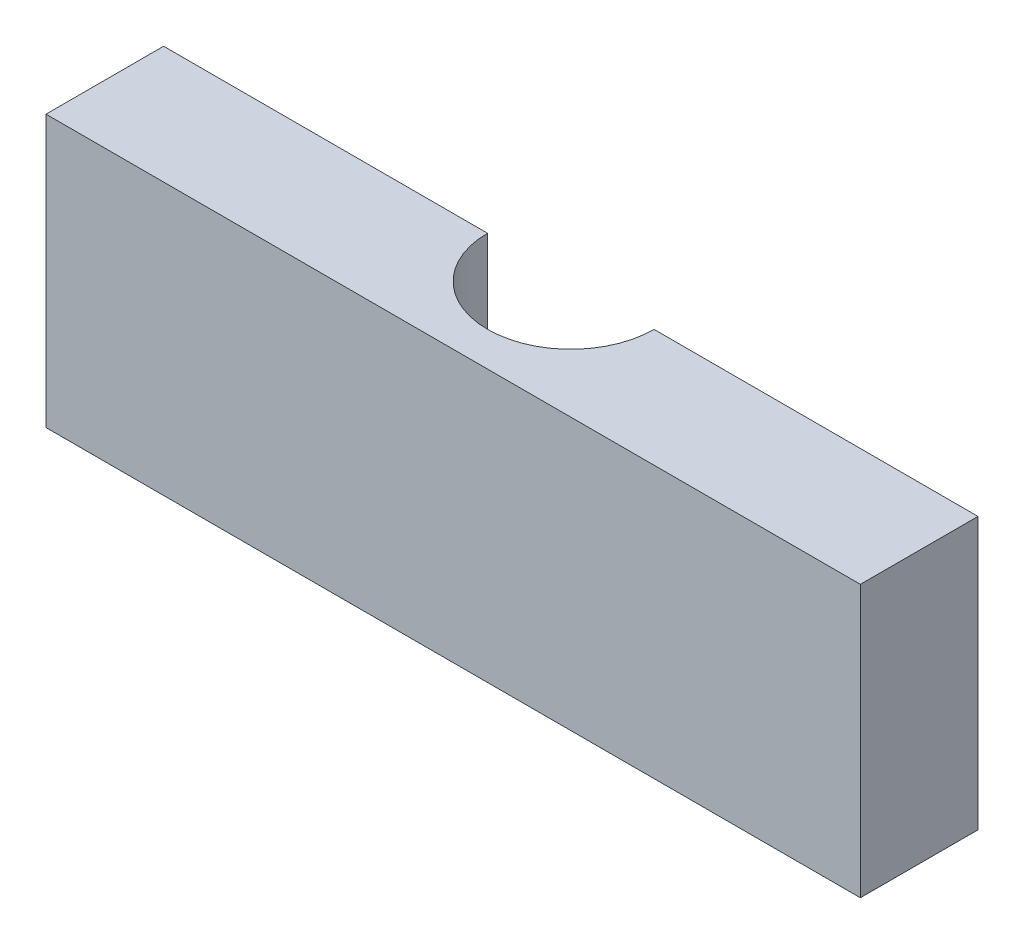
ISO-10303-21;
HEADER;
FILE_DESCRIPTION(('STEP AP214'),'2;1');
FILE_NAME('part.step','',(''),(''),'','','');
FILE_SCHEMA(('AUTOMOTIVE_DESIGN { 1 0 10303 214 1 1 1 1 }'));
ENDSEC;
DATA;
#1=APPLICATION_CONTEXT('core data for automotive mechanical design processes');
#2=APPLICATION_PROTOCOL_DEFINITION('international standard','automotive_design',2000,#1);
#3=PRODUCT_CONTEXT('',#1,'mechanical');
#4=PRODUCT('Part','Part','',(#3));
#5=PRODUCT_RELATED_PRODUCT_CATEGORY('part','',(#4));
#6=PRODUCT_DEFINITION_FORMATION('','',#4);
#7=PRODUCT_DEFINITION_CONTEXT('part definition',#1,'design');
#8=PRODUCT_DEFINITION('design','',#6,#7);
#9=PRODUCT_DEFINITION_SHAPE('','',#8);
#10=(LENGTH_UNIT() NAMED_UNIT(*) SI_UNIT(.MILLI.,.METRE.));
#11=(NAMED_UNIT(*) PLANE_ANGLE_UNIT() SI_UNIT($,.RADIAN.));
#12=(NAMED_UNIT(*) SI_UNIT($,.STERADIAN.) SOLID_ANGLE_UNIT());
#13=UNCERTAINTY_MEASURE_WITH_UNIT(LENGTH_MEASURE(1.E-05),#10,'distance_accuracy_value','');
#14=(GEOMETRIC_REPRESENTATION_CONTEXT(3) GLOBAL_UNCERTAINTY_ASSIGNED_CONTEXT((#13)) GLOBAL_UNIT_ASSIGNED_CONTEXT((#10,
#11,#12)) REPRESENTATION_CONTEXT('',''));
#15=CARTESIAN_POINT('',(0.,0.,0.));
#16=DIRECTION('',(0.,0.,1.));
#17=DIRECTION('',(1.,0.,0.));
#18=AXIS2_PLACEMENT_3D('',#15,#16,#17);
#19=CARTESIAN_POINT('',(0.,0.,0.));
#20=DIRECTION('',(0.,0.,1.));
#21=DIRECTION('',(1.,0.,0.));
#22=AXIS2_PLACEMENT_3D('',#19,#20,#21);
#23=PLANE('',#22);
#24=DIRECTION('',(1.,0.,0.));
#25=VECTOR('',#24,1.);
#26=CARTESIAN_POINT('',(-13.9979123173278,-12.7922755741127,0.));
#27=LINE('',#26,#25);
#28=CARTESIAN_POINT('',(13.1020876826722,-12.7922755741127,0.));
#29=VERTEX_POINT('',#28);
#30=CARTESIAN_POINT('',(31.0020876826722,-12.7922755741127,0.));
#31=VERTEX_POINT('',#30);
#32=EDGE_CURVE('E116',#29,#31,#27,.T.);
#33=ORIENTED_EDGE('',*,*,#32,.F.);
#34=DIRECTION('',(0.,1.,0.));
#35=VECTOR('',#34,1.);
#36=CARTESIAN_POINT('',(13.1020876826722,-12.7922755741127,0.));
#37=LINE('',#36,#35);
#38=CARTESIAN_POINT('',(13.1020876826722,2.20772442588727,0.));
#39=VERTEX_POINT('',#38);
#40=EDGE_CURVE('E11',#29,#39,#37,.T.);
#41=ORIENTED_EDGE('',*,*,#40,.T.);
#42=DIRECTION('',(-1.,0.,0.));
#43=VECTOR('',#42,1.);
#44=CARTESIAN_POINT('',(-13.9979123173278,2.20772442588727,0.));
#45=LINE('',#44,#43);
#46=CARTESIAN_POINT('',(31.0020876826722,2.20772442588727,0.));
#47=VERTEX_POINT('',#46);
#48=EDGE_CURVE('E115',#47,#39,#45,.T.);
#49=ORIENTED_EDGE('',*,*,#48,.F.);
#50=DIRECTION('',(0.,1.,0.));
#51=VECTOR('',#50,1.);
#52=CARTESIAN_POINT('',(31.0020876826722,2.20772442588727,0.));
#53=LINE('',#52,#51);
#54=EDGE_CURVE('E127',#31,#47,#53,.T.);
#55=ORIENTED_EDGE('',*,*,#54,.F.);
#56=EDGE_LOOP('',(#33,#41,#49,#55));
#57=FACE_BOUND('',#56,.T.);
#58=ADVANCED_FACE('F45',(#57),#23,.F.);
#59=CARTESIAN_POINT('',(-13.9979123173278,2.20772442588727,6.5));
#60=DIRECTION('',(1.,0.,0.));
#61=DIRECTION('',(0.,0.,-1.));
#62=AXIS2_PLACEMENT_3D('',#59,#60,#61);
#63=PLANE('',#62);
#64=DIRECTION('',(0.,-1.,0.));
#65=VECTOR('',#64,1.);
#66=CARTESIAN_POINT('',(-13.9979123173278,2.20772442588727,0.));
#67=LINE('',#66,#65);
#68=CARTESIAN_POINT('',(-13.9979123173278,2.20772442588727,0.));
#69=VERTEX_POINT('',#68);
#70=CARTESIAN_POINT('',(-13.9979123173278,-12.7922755741127,0.));
#71=VERTEX_POINT('',#70);
#72=EDGE_CURVE('E154',#69,#71,#67,.T.);
#73=ORIENTED_EDGE('',*,*,#72,.T.);
#74=DIRECTION('',(0.,0.,-1.));
#75=VECTOR('',#74,1.);
#76=CARTESIAN_POINT('',(-13.9979123173278,-12.7922755741127,6.5));
#77=LINE('',#76,#75);
#78=CARTESIAN_POINT('',(-13.9979123173278,-12.7922755741127,6.5));
#79=VERTEX_POINT('',#78);
#80=EDGE_CURVE('E140',#79,#71,#77,.T.);
#81=ORIENTED_EDGE('',*,*,#80,.F.);
#82=DIRECTION('',(0.,-1.,0.));
#83=VECTOR('',#82,1.);
#84=CARTESIAN_POINT('',(-13.9979123173278,2.20772442588727,6.5));
#85=LINE('',#84,#83);
#86=CARTESIAN_POINT('',(-13.9979123173278,2.20772442588727,6.5));
#87=VERTEX_POINT('',#86);
#88=EDGE_CURVE('E122',#87,#79,#85,.T.);
#89=ORIENTED_EDGE('',*,*,#88,.F.);
#90=DIRECTION('',(0.,0.,-1.));
#91=VECTOR('',#90,1.);
#92=CARTESIAN_POINT('',(-13.9979123173278,2.20772442588727,6.5));
#93=LINE('',#92,#91);
#94=EDGE_CURVE('E131',#87,#69,#93,.T.);
#95=ORIENTED_EDGE('',*,*,#94,.T.);
#96=EDGE_LOOP('',(#73,#81,#89,#95));
#97=FACE_BOUND('',#96,.T.);
#98=ADVANCED_FACE('F47',(#97),#63,.F.);
#99=CARTESIAN_POINT('',(-13.9979123173278,-12.7922755741127,6.5));
#100=DIRECTION('',(0.,1.,0.));
#101=DIRECTION('',(0.,0.,1.));
#102=AXIS2_PLACEMENT_3D('',#99,#100,#101);
#103=PLANE('',#102);
#104=CARTESIAN_POINT('',(3.90208768267223,-12.7922755741127,0.));
#105=VERTEX_POINT('',#104);
#106=EDGE_CURVE('E147',#71,#105,#27,.T.);
#107=ORIENTED_EDGE('',*,*,#106,.T.);
#108=CARTESIAN_POINT('',(8.50208768267224,-12.7922755741127,0.));
#109=DIRECTION('',(0.,1.,0.));
#110=DIRECTION('',(0.,0.,1.));
#111=AXIS2_PLACEMENT_3D('',#108,#109,#110);
#112=CIRCLE('',#111,4.6);
#113=EDGE_CURVE('E61',#105,#29,#112,.T.);
#114=ORIENTED_EDGE('',*,*,#113,.T.);
#115=ORIENTED_EDGE('',*,*,#32,.T.);
#116=DIRECTION('',(0.,0.,-1.));
#117=VECTOR('',#116,1.);
#118=CARTESIAN_POINT('',(31.0020876826722,-12.7922755741127,6.5));
#119=LINE('',#118,#117);
#120=CARTESIAN_POINT('',(31.0020876826722,-12.7922755741127,6.5));
#121=VERTEX_POINT('',#120);
#122=EDGE_CURVE('E136',#121,#31,#119,.T.);
#123=ORIENTED_EDGE('',*,*,#122,.F.);
#124=DIRECTION('',(1.,0.,0.));
#125=VECTOR('',#124,1.);
#126=CARTESIAN_POINT('',(-13.9979123173278,-12.7922755741127,6.5));
#127=LINE('',#126,#125);
#128=EDGE_CURVE('E99',#79,#121,#127,.T.);
#129=ORIENTED_EDGE('',*,*,#128,.F.);
#130=ORIENTED_EDGE('',*,*,#80,.T.);
#131=EDGE_LOOP('',(#107,#114,#115,#123,#129,#130));
#132=FACE_BOUND('',#131,.T.);
#133=ADVANCED_FACE('F148',(#132),#103,.F.);
#134=CARTESIAN_POINT('',(31.0020876826722,2.20772442588727,6.5));
#135=DIRECTION('',(-1.,0.,0.));
#136=DIRECTION('',(0.,-1.,0.));
#137=AXIS2_PLACEMENT_3D('',#134,#135,#136);
#138=PLANE('',#137);
#139=ORIENTED_EDGE('',*,*,#54,.T.);
#140=DIRECTION('',(0.,0.,-1.));
#141=VECTOR('',#140,1.);
#142=CARTESIAN_POINT('',(31.0020876826722,2.20772442588727,6.5));
#143=LINE('',#142,#141);
#144=CARTESIAN_POINT('',(31.0020876826722,2.20772442588727,6.5));
#145=VERTEX_POINT('',#144);
#146=EDGE_CURVE('E120',#145,#47,#143,.T.);
#147=ORIENTED_EDGE('',*,*,#146,.F.);
#148=DIRECTION('',(0.,1.,0.));
#149=VECTOR('',#148,1.);
#150=CARTESIAN_POINT('',(31.0020876826722,2.20772442588727,6.5));
#151=LINE('',#150,#149);
#152=EDGE_CURVE('E160',#121,#145,#151,.T.);
#153=ORIENTED_EDGE('',*,*,#152,.F.);
#154=ORIENTED_EDGE('',*,*,#122,.T.);
#155=EDGE_LOOP('',(#139,#147,#153,#154));
#156=FACE_BOUND('',#155,.T.);
#157=ADVANCED_FACE('F170',(#156),#138,.F.);
#158=CARTESIAN_POINT('',(-13.9979123173278,2.20772442588727,6.5));
#159=DIRECTION('',(0.,-1.,0.));
#160=DIRECTION('',(0.,0.,-1.));
#161=AXIS2_PLACEMENT_3D('',#158,#159,#160);
#162=PLANE('',#161);
#163=ORIENTED_EDGE('',*,*,#48,.T.);
#164=CARTESIAN_POINT('',(8.50208768267224,2.20772442588727,0.));
#165=DIRECTION('',(0.,1.,0.));
#166=DIRECTION('',(0.,0.,1.));
#167=AXIS2_PLACEMENT_3D('',#164,#165,#166);
#168=CIRCLE('',#167,4.6);
#169=CARTESIAN_POINT('',(3.90208768267224,2.20772442588727,0.));
#170=VERTEX_POINT('',#169);
#171=EDGE_CURVE('E106',#170,#39,#168,.T.);
#172=ORIENTED_EDGE('',*,*,#171,.F.);
#173=EDGE_CURVE('E91',#170,#69,#45,.T.);
#174=ORIENTED_EDGE('',*,*,#173,.T.);
#175=ORIENTED_EDGE('',*,*,#94,.F.);
#176=DIRECTION('',(-1.,0.,0.));
#177=VECTOR('',#176,1.);
#178=CARTESIAN_POINT('',(-13.9979123173278,2.20772442588727,6.5));
#179=LINE('',#178,#177);
#180=EDGE_CURVE('E70',#145,#87,#179,.T.);
#181=ORIENTED_EDGE('',*,*,#180,.F.);
#182=ORIENTED_EDGE('',*,*,#146,.T.);
#183=EDGE_LOOP('',(#163,#172,#174,#175,#181,#182));
#184=FACE_BOUND('',#183,.T.);
#185=ADVANCED_FACE('F118',(#184),#162,.F.);
#186=CARTESIAN_POINT('',(0.,0.,6.5));
#187=DIRECTION('',(0.,0.,1.));
#188=DIRECTION('',(1.,0.,0.));
#189=AXIS2_PLACEMENT_3D('',#186,#187,#188);
#190=PLANE('',#189);
#191=ORIENTED_EDGE('',*,*,#88,.T.);
#192=ORIENTED_EDGE('',*,*,#128,.T.);
#193=ORIENTED_EDGE('',*,*,#152,.T.);
#194=ORIENTED_EDGE('',*,*,#180,.T.);
#195=EDGE_LOOP('',(#191,#192,#193,#194));
#196=FACE_BOUND('',#195,.T.);
#197=ADVANCED_FACE('F166',(#196),#190,.T.);
#198=ORIENTED_EDGE('',*,*,#173,.F.);
#199=DIRECTION('',(0.,1.,0.));
#200=VECTOR('',#199,1.);
#201=CARTESIAN_POINT('',(3.90208768267224,-12.7922755741127,0.));
#202=LINE('',#201,#200);
#203=EDGE_CURVE('E54',#170,#105,#202,.F.);
#204=ORIENTED_EDGE('',*,*,#203,.T.);
#205=ORIENTED_EDGE('',*,*,#106,.F.);
#206=ORIENTED_EDGE('',*,*,#72,.F.);
#207=EDGE_LOOP('',(#198,#204,#205,#206));
#208=FACE_BOUND('',#207,.T.);
#209=ADVANCED_FACE('F145',(#208),#23,.F.);
#210=CARTESIAN_POINT('',(8.50208768267224,-12.7922755741127,0.));
#211=DIRECTION('',(0.,1.,0.));
#212=DIRECTION('',(0.,0.,1.));
#213=AXIS2_PLACEMENT_3D('',#210,#211,#212);
#214=CYLINDRICAL_SURFACE('',#213,4.6);
#215=ORIENTED_EDGE('',*,*,#113,.F.);
#216=ORIENTED_EDGE('',*,*,#203,.F.);
#217=ORIENTED_EDGE('',*,*,#171,.T.);
#218=ORIENTED_EDGE('',*,*,#40,.F.);
#219=EDGE_LOOP('',(#215,#216,#217,#218));
#220=FACE_BOUND('',#219,.T.);
#221=ADVANCED_FACE('F107',(#220),#214,.F.);
#222=CLOSED_SHELL('',(#58,#98,#133,#157,#185,#197,#209,#221));
#223=MANIFOLD_SOLID_BREP('B2',#222);
#224=ADVANCED_BREP_SHAPE_REPRESENTATION('',(#18,#223),#14);
#225=SHAPE_DEFINITION_REPRESENTATION(#9,#224);
ENDSEC;
END-ISO-10303-21;
